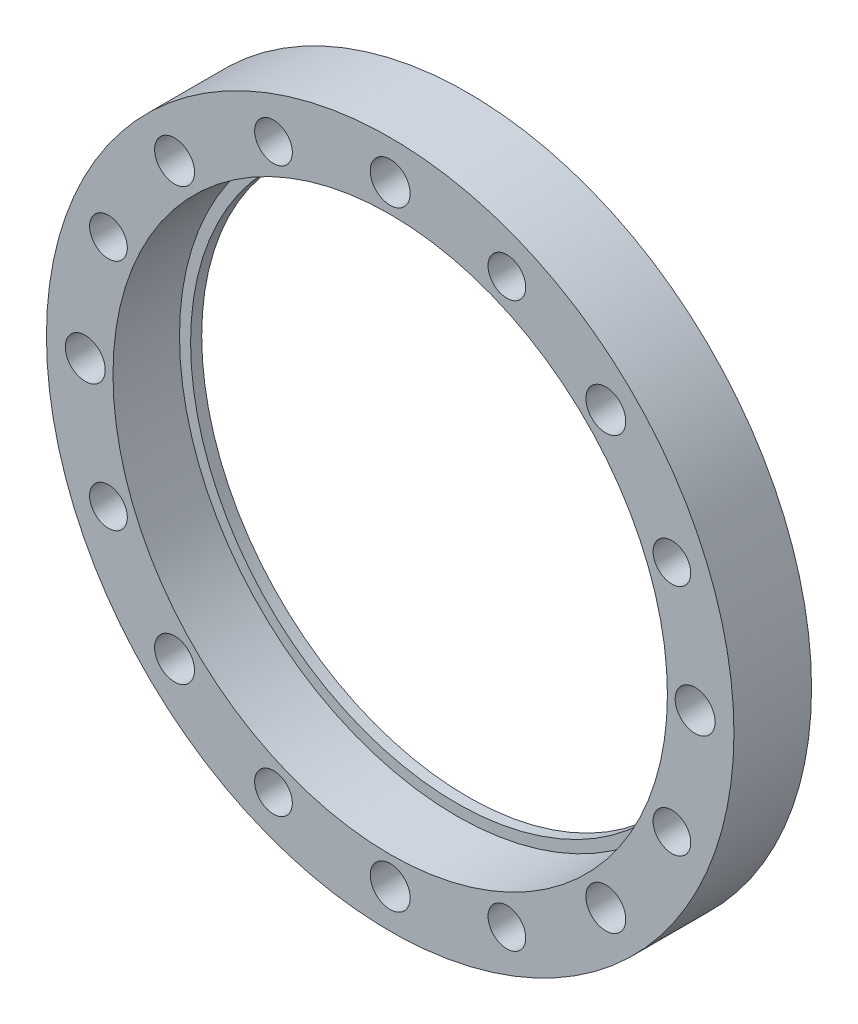
ISO-10303-21;
HEADER;
FILE_DESCRIPTION(('STEP AP214'),'2;1');
FILE_NAME('part.step','',(''),(''),'','','');
FILE_SCHEMA(('AUTOMOTIVE_DESIGN { 1 0 10303 214 1 1 1 1 }'));
ENDSEC;
DATA;
#1=APPLICATION_CONTEXT('core data for automotive mechanical design processes');
#2=APPLICATION_PROTOCOL_DEFINITION('international standard','automotive_design',2000,#1);
#3=PRODUCT_CONTEXT('',#1,'mechanical');
#4=PRODUCT('Part','Part','',(#3));
#5=PRODUCT_RELATED_PRODUCT_CATEGORY('part','',(#4));
#6=PRODUCT_DEFINITION_FORMATION('','',#4);
#7=PRODUCT_DEFINITION_CONTEXT('part definition',#1,'design');
#8=PRODUCT_DEFINITION('design','',#6,#7);
#9=PRODUCT_DEFINITION_SHAPE('','',#8);
#10=(LENGTH_UNIT() NAMED_UNIT(*) SI_UNIT(.MILLI.,.METRE.));
#11=(NAMED_UNIT(*) PLANE_ANGLE_UNIT() SI_UNIT($,.RADIAN.));
#12=(NAMED_UNIT(*) SI_UNIT($,.STERADIAN.) SOLID_ANGLE_UNIT());
#13=UNCERTAINTY_MEASURE_WITH_UNIT(LENGTH_MEASURE(1.E-05),#10,'distance_accuracy_value','');
#14=(GEOMETRIC_REPRESENTATION_CONTEXT(3) GLOBAL_UNCERTAINTY_ASSIGNED_CONTEXT((#13)) GLOBAL_UNIT_ASSIGNED_CONTEXT((#10,
#11,#12)) REPRESENTATION_CONTEXT('',''));
#15=CARTESIAN_POINT('',(0.,0.,0.));
#16=DIRECTION('',(0.,0.,1.));
#17=DIRECTION('',(1.,0.,0.));
#18=AXIS2_PLACEMENT_3D('',#15,#16,#17);
#19=CARTESIAN_POINT('',(0.,0.,6.));
#20=DIRECTION('',(0.,0.,-1.));
#21=DIRECTION('',(-1.,0.,0.));
#22=AXIS2_PLACEMENT_3D('',#19,#20,#21);
#23=CYLINDRICAL_SURFACE('',#22,31.);
#24=CARTESIAN_POINT('',(0.,0.,6.));
#25=DIRECTION('',(0.,0.,1.));
#26=DIRECTION('',(1.,0.,0.));
#27=AXIS2_PLACEMENT_3D('',#24,#25,#26);
#28=CIRCLE('',#27,31.);
#29=CARTESIAN_POINT('',(31.,0.,6.));
#30=VERTEX_POINT('',#29);
#31=EDGE_CURVE('E10',#30,#30,#28,.T.);
#32=ORIENTED_EDGE('',*,*,#31,.F.);
#33=EDGE_LOOP('',(#32));
#34=FACE_BOUND('',#33,.T.);
#35=CARTESIAN_POINT('',(0.,0.,-1.));
#36=DIRECTION('',(0.,0.,-1.));
#37=DIRECTION('',(-1.,0.,0.));
#38=AXIS2_PLACEMENT_3D('',#35,#36,#37);
#39=CIRCLE('',#38,31.);
#40=CARTESIAN_POINT('',(-31.,0.,-1.));
#41=VERTEX_POINT('',#40);
#42=EDGE_CURVE('E46',#41,#41,#39,.T.);
#43=ORIENTED_EDGE('',*,*,#42,.F.);
#44=EDGE_LOOP('',(#43));
#45=FACE_BOUND('',#44,.T.);
#46=ADVANCED_FACE('F31',(#34,#45),#23,.T.);
#47=CARTESIAN_POINT('',(0.,0.,6.));
#48=DIRECTION('',(0.,0.,1.));
#49=DIRECTION('',(1.,0.,0.));
#50=AXIS2_PLACEMENT_3D('',#47,#48,#49);
#51=PLANE('',#50);
#52=CARTESIAN_POINT('',(25.4066871440602,10.5237943900404,6.));
#53=DIRECTION('',(0.,0.,-1.));
#54=DIRECTION('',(-1.,0.,0.));
#55=AXIS2_PLACEMENT_3D('',#52,#53,#54);
#56=CIRCLE('',#55,1.7);
#57=CARTESIAN_POINT('',(23.7066871440602,10.5237943900404,6.));
#58=VERTEX_POINT('',#57);
#59=EDGE_CURVE('E170',#58,#58,#56,.T.);
#60=ORIENTED_EDGE('',*,*,#59,.T.);
#61=EDGE_LOOP('',(#60));
#62=FACE_BOUND('',#61,.T.);
#63=CARTESIAN_POINT('',(25.4066871440606,-10.5237943900395,6.));
#64=DIRECTION('',(0.,0.,-1.));
#65=DIRECTION('',(-1.,0.,0.));
#66=AXIS2_PLACEMENT_3D('',#63,#64,#65);
#67=CIRCLE('',#66,1.7);
#68=CARTESIAN_POINT('',(23.7066871440606,-10.5237943900395,6.));
#69=VERTEX_POINT('',#68);
#70=EDGE_CURVE('E164',#69,#69,#67,.T.);
#71=ORIENTED_EDGE('',*,*,#70,.T.);
#72=EDGE_LOOP('',(#71));
#73=FACE_BOUND('',#72,.T.);
#74=CARTESIAN_POINT('',(10.5237943900403,-25.4066871440602,6.));
#75=DIRECTION('',(0.,0.,-1.));
#76=DIRECTION('',(-1.,0.,0.));
#77=AXIS2_PLACEMENT_3D('',#74,#75,#76);
#78=CIRCLE('',#77,1.7);
#79=CARTESIAN_POINT('',(8.82379439004034,-25.4066871440602,6.));
#80=VERTEX_POINT('',#79);
#81=EDGE_CURVE('E158',#80,#80,#78,.T.);
#82=ORIENTED_EDGE('',*,*,#81,.T.);
#83=EDGE_LOOP('',(#82));
#84=FACE_BOUND('',#83,.T.);
#85=CARTESIAN_POINT('',(-10.5237943900398,-25.4066871440604,6.));
#86=DIRECTION('',(0.,0.,-1.));
#87=DIRECTION('',(-1.,0.,0.));
#88=AXIS2_PLACEMENT_3D('',#85,#86,#87);
#89=CIRCLE('',#88,1.7);
#90=CARTESIAN_POINT('',(-12.2237943900398,-25.4066871440604,6.));
#91=VERTEX_POINT('',#90);
#92=EDGE_CURVE('E152',#91,#91,#89,.T.);
#93=ORIENTED_EDGE('',*,*,#92,.T.);
#94=EDGE_LOOP('',(#93));
#95=FACE_BOUND('',#94,.T.);
#96=CARTESIAN_POINT('',(-25.4066871440603,-10.5237943900403,6.));
#97=DIRECTION('',(0.,0.,-1.));
#98=DIRECTION('',(-1.,0.,0.));
#99=AXIS2_PLACEMENT_3D('',#96,#97,#98);
#100=CIRCLE('',#99,1.7);
#101=CARTESIAN_POINT('',(-27.1066871440603,-10.5237943900403,6.));
#102=VERTEX_POINT('',#101);
#103=EDGE_CURVE('E146',#102,#102,#100,.T.);
#104=ORIENTED_EDGE('',*,*,#103,.T.);
#105=EDGE_LOOP('',(#104));
#106=FACE_BOUND('',#105,.T.);
#107=CARTESIAN_POINT('',(-25.4066871440605,10.5237943900397,6.));
#108=DIRECTION('',(0.,0.,-1.));
#109=DIRECTION('',(-1.,0.,0.));
#110=AXIS2_PLACEMENT_3D('',#107,#108,#109);
#111=CIRCLE('',#110,1.7);
#112=CARTESIAN_POINT('',(-27.1066871440605,10.5237943900397,6.));
#113=VERTEX_POINT('',#112);
#114=EDGE_CURVE('E140',#113,#113,#111,.T.);
#115=ORIENTED_EDGE('',*,*,#114,.T.);
#116=EDGE_LOOP('',(#115));
#117=FACE_BOUND('',#116,.T.);
#118=CARTESIAN_POINT('',(-10.5237943900402,25.4066871440603,6.));
#119=DIRECTION('',(0.,0.,-1.));
#120=DIRECTION('',(-1.,0.,0.));
#121=AXIS2_PLACEMENT_3D('',#118,#119,#120);
#122=CIRCLE('',#121,1.7);
#123=CARTESIAN_POINT('',(-12.2237943900402,25.4066871440603,6.));
#124=VERTEX_POINT('',#123);
#125=EDGE_CURVE('E134',#124,#124,#122,.T.);
#126=ORIENTED_EDGE('',*,*,#125,.T.);
#127=EDGE_LOOP('',(#126));
#128=FACE_BOUND('',#127,.T.);
#129=CARTESIAN_POINT('',(10.5237943900398,25.4066871440604,6.));
#130=DIRECTION('',(0.,0.,-1.));
#131=DIRECTION('',(-1.,0.,0.));
#132=AXIS2_PLACEMENT_3D('',#129,#130,#131);
#133=CIRCLE('',#132,1.7);
#134=CARTESIAN_POINT('',(8.82379439003982,25.4066871440604,6.));
#135=VERTEX_POINT('',#134);
#136=EDGE_CURVE('E128',#135,#135,#133,.T.);
#137=ORIENTED_EDGE('',*,*,#136,.T.);
#138=EDGE_LOOP('',(#137));
#139=FACE_BOUND('',#138,.T.);
#140=CARTESIAN_POINT('',(19.4454364826298,19.4454364826303,6.));
#141=DIRECTION('',(0.,0.,-1.));
#142=DIRECTION('',(-1.,0.,0.));
#143=AXIS2_PLACEMENT_3D('',#140,#141,#142);
#144=CIRCLE('',#143,1.8);
#145=CARTESIAN_POINT('',(17.6454364826298,19.4454364826303,6.));
#146=VERTEX_POINT('',#145);
#147=EDGE_CURVE('E119',#146,#146,#144,.T.);
#148=ORIENTED_EDGE('',*,*,#147,.T.);
#149=EDGE_LOOP('',(#148));
#150=FACE_BOUND('',#149,.T.);
#151=CARTESIAN_POINT('',(27.5,2.88047210454558E-13,6.));
#152=DIRECTION('',(0.,0.,-1.));
#153=DIRECTION('',(-1.,0.,0.));
#154=AXIS2_PLACEMENT_3D('',#151,#152,#153);
#155=CIRCLE('',#154,1.8);
#156=CARTESIAN_POINT('',(25.7,2.88047210454558E-13,6.));
#157=VERTEX_POINT('',#156);
#158=EDGE_CURVE('E110',#157,#157,#155,.T.);
#159=ORIENTED_EDGE('',*,*,#158,.T.);
#160=EDGE_LOOP('',(#159));
#161=FACE_BOUND('',#160,.T.);
#162=CARTESIAN_POINT('',(19.4454364826302,-19.4454364826299,6.));
#163=DIRECTION('',(0.,0.,-1.));
#164=DIRECTION('',(-1.,0.,0.));
#165=AXIS2_PLACEMENT_3D('',#162,#163,#164);
#166=CIRCLE('',#165,1.8);
#167=CARTESIAN_POINT('',(17.6454364826302,-19.4454364826299,6.));
#168=VERTEX_POINT('',#167);
#169=EDGE_CURVE('E101',#168,#168,#166,.T.);
#170=ORIENTED_EDGE('',*,*,#169,.T.);
#171=EDGE_LOOP('',(#170));
#172=FACE_BOUND('',#171,.T.);
#173=CARTESIAN_POINT('',(0.,-27.5,6.));
#174=DIRECTION('',(0.,0.,-1.));
#175=DIRECTION('',(-1.,0.,0.));
#176=AXIS2_PLACEMENT_3D('',#173,#174,#175);
#177=CIRCLE('',#176,1.8);
#178=CARTESIAN_POINT('',(-1.8,-27.5,6.));
#179=VERTEX_POINT('',#178);
#180=EDGE_CURVE('E92',#179,#179,#177,.T.);
#181=ORIENTED_EDGE('',*,*,#180,.T.);
#182=EDGE_LOOP('',(#181));
#183=FACE_BOUND('',#182,.T.);
#184=CARTESIAN_POINT('',(-19.44543648263,-19.4454364826302,6.));
#185=DIRECTION('',(0.,0.,-1.));
#186=DIRECTION('',(-1.,0.,0.));
#187=AXIS2_PLACEMENT_3D('',#184,#185,#186);
#188=CIRCLE('',#187,1.8);
#189=CARTESIAN_POINT('',(-21.24543648263,-19.4454364826302,6.));
#190=VERTEX_POINT('',#189);
#191=EDGE_CURVE('E83',#190,#190,#188,.T.);
#192=ORIENTED_EDGE('',*,*,#191,.T.);
#193=EDGE_LOOP('',(#192));
#194=FACE_BOUND('',#193,.T.);
#195=CARTESIAN_POINT('',(-27.5,0.,6.));
#196=DIRECTION('',(0.,0.,-1.));
#197=DIRECTION('',(-1.,0.,0.));
#198=AXIS2_PLACEMENT_3D('',#195,#196,#197);
#199=CIRCLE('',#198,1.8);
#200=CARTESIAN_POINT('',(-29.3,0.,6.));
#201=VERTEX_POINT('',#200);
#202=EDGE_CURVE('E74',#201,#201,#199,.T.);
#203=ORIENTED_EDGE('',*,*,#202,.T.);
#204=EDGE_LOOP('',(#203));
#205=FACE_BOUND('',#204,.T.);
#206=CARTESIAN_POINT('',(-19.4454364826301,19.44543648263,6.));
#207=DIRECTION('',(0.,0.,-1.));
#208=DIRECTION('',(-1.,0.,0.));
#209=AXIS2_PLACEMENT_3D('',#206,#207,#208);
#210=CIRCLE('',#209,1.8);
#211=CARTESIAN_POINT('',(-21.2454364826301,19.44543648263,6.));
#212=VERTEX_POINT('',#211);
#213=EDGE_CURVE('E65',#212,#212,#210,.T.);
#214=ORIENTED_EDGE('',*,*,#213,.T.);
#215=EDGE_LOOP('',(#214));
#216=FACE_BOUND('',#215,.T.);
#217=CARTESIAN_POINT('',(0.,27.5,6.));
#218=DIRECTION('',(0.,0.,-1.));
#219=DIRECTION('',(-1.,0.,0.));
#220=AXIS2_PLACEMENT_3D('',#217,#218,#219);
#221=CIRCLE('',#220,1.8);
#222=CARTESIAN_POINT('',(-1.8,27.5,6.));
#223=VERTEX_POINT('',#222);
#224=EDGE_CURVE('E54',#223,#223,#221,.T.);
#225=ORIENTED_EDGE('',*,*,#224,.T.);
#226=EDGE_LOOP('',(#225));
#227=FACE_BOUND('',#226,.T.);
#228=CARTESIAN_POINT('',(0.,0.,6.));
#229=DIRECTION('',(0.,0.,-1.));
#230=DIRECTION('',(-1.,0.,0.));
#231=AXIS2_PLACEMENT_3D('',#228,#229,#230);
#232=CIRCLE('',#231,25.);
#233=CARTESIAN_POINT('',(-25.,0.,6.));
#234=VERTEX_POINT('',#233);
#235=EDGE_CURVE('E37',#234,#234,#232,.T.);
#236=ORIENTED_EDGE('',*,*,#235,.T.);
#237=EDGE_LOOP('',(#236));
#238=FACE_BOUND('',#237,.T.);
#239=ORIENTED_EDGE('',*,*,#31,.T.);
#240=EDGE_LOOP('',(#239));
#241=FACE_BOUND('',#240,.T.);
#242=ADVANCED_FACE('F232',(#62,#73,#84,#95,#106,#117,#128,#139,#150,#161,#172,#183,#194,#205,
#216,#227,#238,#241),#51,.T.);
#243=CARTESIAN_POINT('',(0.,0.,6.));
#244=DIRECTION('',(0.,0.,-1.));
#245=DIRECTION('',(-1.,0.,0.));
#246=AXIS2_PLACEMENT_3D('',#243,#244,#245);
#247=CYLINDRICAL_SURFACE('',#246,25.);
#248=ORIENTED_EDGE('',*,*,#235,.F.);
#249=EDGE_LOOP('',(#248));
#250=FACE_BOUND('',#249,.T.);
#251=CARTESIAN_POINT('',(0.,0.,0.));
#252=DIRECTION('',(0.,0.,-1.));
#253=DIRECTION('',(-1.,0.,0.));
#254=AXIS2_PLACEMENT_3D('',#251,#252,#253);
#255=CIRCLE('',#254,25.);
#256=CARTESIAN_POINT('',(-25.,0.,0.));
#257=VERTEX_POINT('',#256);
#258=EDGE_CURVE('E41',#257,#257,#255,.T.);
#259=ORIENTED_EDGE('',*,*,#258,.T.);
#260=EDGE_LOOP('',(#259));
#261=FACE_BOUND('',#260,.T.);
#262=ADVANCED_FACE('F227',(#250,#261),#247,.F.);
#263=CARTESIAN_POINT('',(0.,0.,0.));
#264=DIRECTION('',(0.,0.,-1.));
#265=DIRECTION('',(-1.,0.,0.));
#266=AXIS2_PLACEMENT_3D('',#263,#264,#265);
#267=PLANE('',#266);
#268=CARTESIAN_POINT('',(0.,0.,0.));
#269=DIRECTION('',(0.,0.,-1.));
#270=DIRECTION('',(-1.,0.,0.));
#271=AXIS2_PLACEMENT_3D('',#268,#269,#270);
#272=CIRCLE('',#271,24.);
#273=CARTESIAN_POINT('',(-24.,0.,0.));
#274=VERTEX_POINT('',#273);
#275=EDGE_CURVE('E51',#274,#274,#272,.T.);
#276=ORIENTED_EDGE('',*,*,#275,.T.);
#277=EDGE_LOOP('',(#276));
#278=FACE_BOUND('',#277,.T.);
#279=ORIENTED_EDGE('',*,*,#258,.F.);
#280=EDGE_LOOP('',(#279));
#281=FACE_BOUND('',#280,.T.);
#282=ADVANCED_FACE('F183',(#278,#281),#267,.F.);
#283=CARTESIAN_POINT('',(0.,0.,-1.));
#284=DIRECTION('',(0.,0.,-1.));
#285=DIRECTION('',(-1.,0.,0.));
#286=AXIS2_PLACEMENT_3D('',#283,#284,#285);
#287=PLANE('',#286);
#288=CARTESIAN_POINT('',(25.4066871440602,10.5237943900404,-1.));
#289=DIRECTION('',(0.,0.,-1.));
#290=DIRECTION('',(-1.,0.,0.));
#291=AXIS2_PLACEMENT_3D('',#288,#289,#290);
#292=CIRCLE('',#291,1.69999999999999);
#293=CARTESIAN_POINT('',(23.7066871440602,10.5237943900404,-1.));
#294=VERTEX_POINT('',#293);
#295=EDGE_CURVE('E173',#294,#294,#292,.T.);
#296=ORIENTED_EDGE('',*,*,#295,.F.);
#297=EDGE_LOOP('',(#296));
#298=FACE_BOUND('',#297,.T.);
#299=CARTESIAN_POINT('',(25.4066871440606,-10.5237943900395,-1.));
#300=DIRECTION('',(0.,0.,-1.));
#301=DIRECTION('',(-1.,0.,0.));
#302=AXIS2_PLACEMENT_3D('',#299,#300,#301);
#303=CIRCLE('',#302,1.69999999999999);
#304=CARTESIAN_POINT('',(23.7066871440606,-10.5237943900395,-1.));
#305=VERTEX_POINT('',#304);
#306=EDGE_CURVE('E167',#305,#305,#303,.T.);
#307=ORIENTED_EDGE('',*,*,#306,.F.);
#308=EDGE_LOOP('',(#307));
#309=FACE_BOUND('',#308,.T.);
#310=CARTESIAN_POINT('',(10.5237943900403,-25.4066871440602,-1.));
#311=DIRECTION('',(0.,0.,-1.));
#312=DIRECTION('',(-1.,0.,0.));
#313=AXIS2_PLACEMENT_3D('',#310,#311,#312);
#314=CIRCLE('',#313,1.69999999999999);
#315=CARTESIAN_POINT('',(8.82379439004036,-25.4066871440602,-1.));
#316=VERTEX_POINT('',#315);
#317=EDGE_CURVE('E161',#316,#316,#314,.T.);
#318=ORIENTED_EDGE('',*,*,#317,.F.);
#319=EDGE_LOOP('',(#318));
#320=FACE_BOUND('',#319,.T.);
#321=CARTESIAN_POINT('',(-10.5237943900398,-25.4066871440604,-1.));
#322=DIRECTION('',(0.,0.,-1.));
#323=DIRECTION('',(-1.,0.,0.));
#324=AXIS2_PLACEMENT_3D('',#321,#322,#323);
#325=CIRCLE('',#324,1.69999999999999);
#326=CARTESIAN_POINT('',(-12.2237943900398,-25.4066871440604,-1.));
#327=VERTEX_POINT('',#326);
#328=EDGE_CURVE('E155',#327,#327,#325,.T.);
#329=ORIENTED_EDGE('',*,*,#328,.F.);
#330=EDGE_LOOP('',(#329));
#331=FACE_BOUND('',#330,.T.);
#332=CARTESIAN_POINT('',(-25.4066871440603,-10.5237943900403,-1.));
#333=DIRECTION('',(0.,0.,-1.));
#334=DIRECTION('',(-1.,0.,0.));
#335=AXIS2_PLACEMENT_3D('',#332,#333,#334);
#336=CIRCLE('',#335,1.69999999999999);
#337=CARTESIAN_POINT('',(-27.1066871440603,-10.5237943900403,-1.));
#338=VERTEX_POINT('',#337);
#339=EDGE_CURVE('E149',#338,#338,#336,.T.);
#340=ORIENTED_EDGE('',*,*,#339,.F.);
#341=EDGE_LOOP('',(#340));
#342=FACE_BOUND('',#341,.T.);
#343=CARTESIAN_POINT('',(-25.4066871440605,10.5237943900397,-1.));
#344=DIRECTION('',(0.,0.,-1.));
#345=DIRECTION('',(-1.,0.,0.));
#346=AXIS2_PLACEMENT_3D('',#343,#344,#345);
#347=CIRCLE('',#346,1.69999999999999);
#348=CARTESIAN_POINT('',(-27.1066871440605,10.5237943900397,-1.));
#349=VERTEX_POINT('',#348);
#350=EDGE_CURVE('E143',#349,#349,#347,.T.);
#351=ORIENTED_EDGE('',*,*,#350,.F.);
#352=EDGE_LOOP('',(#351));
#353=FACE_BOUND('',#352,.T.);
#354=CARTESIAN_POINT('',(-10.5237943900402,25.4066871440603,-1.));
#355=DIRECTION('',(0.,0.,-1.));
#356=DIRECTION('',(-1.,0.,0.));
#357=AXIS2_PLACEMENT_3D('',#354,#355,#356);
#358=CIRCLE('',#357,1.69999999999999);
#359=CARTESIAN_POINT('',(-12.2237943900402,25.4066871440603,-1.));
#360=VERTEX_POINT('',#359);
#361=EDGE_CURVE('E137',#360,#360,#358,.T.);
#362=ORIENTED_EDGE('',*,*,#361,.F.);
#363=EDGE_LOOP('',(#362));
#364=FACE_BOUND('',#363,.T.);
#365=CARTESIAN_POINT('',(10.5237943900398,25.4066871440604,-1.));
#366=DIRECTION('',(0.,0.,-1.));
#367=DIRECTION('',(-1.,0.,0.));
#368=AXIS2_PLACEMENT_3D('',#365,#366,#367);
#369=CIRCLE('',#368,1.69999999999999);
#370=CARTESIAN_POINT('',(8.82379439003983,25.4066871440604,-1.));
#371=VERTEX_POINT('',#370);
#372=EDGE_CURVE('E131',#371,#371,#369,.T.);
#373=ORIENTED_EDGE('',*,*,#372,.F.);
#374=EDGE_LOOP('',(#373));
#375=FACE_BOUND('',#374,.T.);
#376=CARTESIAN_POINT('',(19.4454364826298,19.4454364826303,-1.));
#377=DIRECTION('',(0.,0.,-1.));
#378=DIRECTION('',(-1.,0.,0.));
#379=AXIS2_PLACEMENT_3D('',#376,#377,#378);
#380=CIRCLE('',#379,3.15);
#381=CARTESIAN_POINT('',(16.2954364826298,19.4454364826303,-1.));
#382=VERTEX_POINT('',#381);
#383=EDGE_CURVE('E125',#382,#382,#380,.T.);
#384=ORIENTED_EDGE('',*,*,#383,.F.);
#385=EDGE_LOOP('',(#384));
#386=FACE_BOUND('',#385,.T.);
#387=CARTESIAN_POINT('',(27.5,2.88047210454558E-13,-1.));
#388=DIRECTION('',(0.,0.,-1.));
#389=DIRECTION('',(-1.,0.,0.));
#390=AXIS2_PLACEMENT_3D('',#387,#388,#389);
#391=CIRCLE('',#390,3.15);
#392=CARTESIAN_POINT('',(24.35,2.88047210454558E-13,-1.));
#393=VERTEX_POINT('',#392);
#394=EDGE_CURVE('E116',#393,#393,#391,.T.);
#395=ORIENTED_EDGE('',*,*,#394,.F.);
#396=EDGE_LOOP('',(#395));
#397=FACE_BOUND('',#396,.T.);
#398=CARTESIAN_POINT('',(19.4454364826302,-19.4454364826299,-1.));
#399=DIRECTION('',(0.,0.,-1.));
#400=DIRECTION('',(-1.,0.,0.));
#401=AXIS2_PLACEMENT_3D('',#398,#399,#400);
#402=CIRCLE('',#401,3.15);
#403=CARTESIAN_POINT('',(16.2954364826302,-19.4454364826299,-1.));
#404=VERTEX_POINT('',#403);
#405=EDGE_CURVE('E107',#404,#404,#402,.T.);
#406=ORIENTED_EDGE('',*,*,#405,.F.);
#407=EDGE_LOOP('',(#406));
#408=FACE_BOUND('',#407,.T.);
#409=CARTESIAN_POINT('',(0.,-27.5,-1.));
#410=DIRECTION('',(0.,0.,-1.));
#411=DIRECTION('',(-1.,0.,0.));
#412=AXIS2_PLACEMENT_3D('',#409,#410,#411);
#413=CIRCLE('',#412,3.15);
#414=CARTESIAN_POINT('',(-3.15,-27.5,-1.));
#415=VERTEX_POINT('',#414);
#416=EDGE_CURVE('E98',#415,#415,#413,.T.);
#417=ORIENTED_EDGE('',*,*,#416,.F.);
#418=EDGE_LOOP('',(#417));
#419=FACE_BOUND('',#418,.T.);
#420=CARTESIAN_POINT('',(-19.44543648263,-19.4454364826302,-1.));
#421=DIRECTION('',(0.,0.,-1.));
#422=DIRECTION('',(-1.,0.,0.));
#423=AXIS2_PLACEMENT_3D('',#420,#421,#422);
#424=CIRCLE('',#423,3.15);
#425=CARTESIAN_POINT('',(-22.59543648263,-19.4454364826302,-1.));
#426=VERTEX_POINT('',#425);
#427=EDGE_CURVE('E89',#426,#426,#424,.T.);
#428=ORIENTED_EDGE('',*,*,#427,.F.);
#429=EDGE_LOOP('',(#428));
#430=FACE_BOUND('',#429,.T.);
#431=CARTESIAN_POINT('',(-27.5,0.,-1.));
#432=DIRECTION('',(0.,0.,-1.));
#433=DIRECTION('',(-1.,0.,0.));
#434=AXIS2_PLACEMENT_3D('',#431,#432,#433);
#435=CIRCLE('',#434,3.15);
#436=CARTESIAN_POINT('',(-30.65,0.,-1.));
#437=VERTEX_POINT('',#436);
#438=EDGE_CURVE('E80',#437,#437,#435,.T.);
#439=ORIENTED_EDGE('',*,*,#438,.F.);
#440=EDGE_LOOP('',(#439));
#441=FACE_BOUND('',#440,.T.);
#442=CARTESIAN_POINT('',(-19.4454364826301,19.44543648263,-1.));
#443=DIRECTION('',(0.,0.,-1.));
#444=DIRECTION('',(-1.,0.,0.));
#445=AXIS2_PLACEMENT_3D('',#442,#443,#444);
#446=CIRCLE('',#445,3.15);
#447=CARTESIAN_POINT('',(-22.5954364826301,19.44543648263,-1.));
#448=VERTEX_POINT('',#447);
#449=EDGE_CURVE('E71',#448,#448,#446,.T.);
#450=ORIENTED_EDGE('',*,*,#449,.F.);
#451=EDGE_LOOP('',(#450));
#452=FACE_BOUND('',#451,.T.);
#453=CARTESIAN_POINT('',(0.,27.5,-1.));
#454=DIRECTION('',(0.,0.,-1.));
#455=DIRECTION('',(-1.,0.,0.));
#456=AXIS2_PLACEMENT_3D('',#453,#454,#455);
#457=CIRCLE('',#456,3.15);
#458=CARTESIAN_POINT('',(-3.15,27.5,-1.));
#459=VERTEX_POINT('',#458);
#460=EDGE_CURVE('E62',#459,#459,#457,.T.);
#461=ORIENTED_EDGE('',*,*,#460,.F.);
#462=EDGE_LOOP('',(#461));
#463=FACE_BOUND('',#462,.T.);
#464=ORIENTED_EDGE('',*,*,#42,.T.);
#465=EDGE_LOOP('',(#464));
#466=FACE_BOUND('',#465,.T.);
#467=CARTESIAN_POINT('',(0.,0.,-1.));
#468=DIRECTION('',(0.,0.,-1.));
#469=DIRECTION('',(-1.,0.,0.));
#470=AXIS2_PLACEMENT_3D('',#467,#468,#469);
#471=CIRCLE('',#470,24.);
#472=CARTESIAN_POINT('',(-24.,0.,-1.));
#473=VERTEX_POINT('',#472);
#474=EDGE_CURVE('E50',#473,#473,#471,.T.);
#475=ORIENTED_EDGE('',*,*,#474,.F.);
#476=EDGE_LOOP('',(#475));
#477=FACE_BOUND('',#476,.T.);
#478=ADVANCED_FACE('F179',(#298,#309,#320,#331,#342,#353,#364,#375,#386,#397,#408,#419,#430,
#441,#452,#463,#466,#477),#287,.T.);
#479=CARTESIAN_POINT('',(0.,0.,-1.));
#480=DIRECTION('',(0.,0.,1.));
#481=DIRECTION('',(1.,0.,0.));
#482=AXIS2_PLACEMENT_3D('',#479,#480,#481);
#483=CYLINDRICAL_SURFACE('',#482,24.);
#484=ORIENTED_EDGE('',*,*,#474,.T.);
#485=EDGE_LOOP('',(#484));
#486=FACE_BOUND('',#485,.T.);
#487=ORIENTED_EDGE('',*,*,#275,.F.);
#488=EDGE_LOOP('',(#487));
#489=FACE_BOUND('',#488,.T.);
#490=ADVANCED_FACE('F182',(#486,#489),#483,.F.);
#491=CARTESIAN_POINT('',(0.,27.5,-1.));
#492=DIRECTION('',(0.,0.,-1.));
#493=DIRECTION('',(-1.,0.,0.));
#494=AXIS2_PLACEMENT_3D('',#491,#492,#493);
#495=CYLINDRICAL_SURFACE('',#494,1.8);
#496=ORIENTED_EDGE('',*,*,#224,.F.);
#497=EDGE_LOOP('',(#496));
#498=FACE_BOUND('',#497,.T.);
#499=CARTESIAN_POINT('',(0.,27.5,0.35));
#500=DIRECTION('',(0.,0.,-1.));
#501=DIRECTION('',(-1.,0.,0.));
#502=AXIS2_PLACEMENT_3D('',#499,#500,#501);
#503=CIRCLE('',#502,1.8);
#504=CARTESIAN_POINT('',(-1.8,27.5,0.35));
#505=VERTEX_POINT('',#504);
#506=EDGE_CURVE('E59',#505,#505,#503,.T.);
#507=ORIENTED_EDGE('',*,*,#506,.T.);
#508=EDGE_LOOP('',(#507));
#509=FACE_BOUND('',#508,.T.);
#510=ADVANCED_FACE('F221',(#498,#509),#495,.F.);
#511=CARTESIAN_POINT('',(0.,27.5,-1.));
#512=DIRECTION('',(0.,0.,-1.));
#513=DIRECTION('',(-1.,0.,0.));
#514=AXIS2_PLACEMENT_3D('',#511,#512,#513);
#515=CONICAL_SURFACE('',#514,3.15,0.785398163397449);
#516=ORIENTED_EDGE('',*,*,#506,.F.);
#517=EDGE_LOOP('',(#516));
#518=FACE_BOUND('',#517,.T.);
#519=ORIENTED_EDGE('',*,*,#460,.T.);
#520=EDGE_LOOP('',(#519));
#521=FACE_BOUND('',#520,.T.);
#522=ADVANCED_FACE('F397',(#518,#521),#515,.F.);
#523=CARTESIAN_POINT('',(-19.4454364826301,19.44543648263,-1.));
#524=DIRECTION('',(0.,0.,-1.));
#525=DIRECTION('',(-1.,0.,0.));
#526=AXIS2_PLACEMENT_3D('',#523,#524,#525);
#527=CYLINDRICAL_SURFACE('',#526,1.8);
#528=ORIENTED_EDGE('',*,*,#213,.F.);
#529=EDGE_LOOP('',(#528));
#530=FACE_BOUND('',#529,.T.);
#531=CARTESIAN_POINT('',(-19.4454364826301,19.44543648263,0.35));
#532=DIRECTION('',(0.,0.,-1.));
#533=DIRECTION('',(-1.,0.,0.));
#534=AXIS2_PLACEMENT_3D('',#531,#532,#533);
#535=CIRCLE('',#534,1.8);
#536=CARTESIAN_POINT('',(-21.2454364826301,19.44543648263,0.35));
#537=VERTEX_POINT('',#536);
#538=EDGE_CURVE('E68',#537,#537,#535,.T.);
#539=ORIENTED_EDGE('',*,*,#538,.T.);
#540=EDGE_LOOP('',(#539));
#541=FACE_BOUND('',#540,.T.);
#542=ADVANCED_FACE('F393',(#530,#541),#527,.F.);
#543=CARTESIAN_POINT('',(-19.4454364826301,19.44543648263,-1.));
#544=DIRECTION('',(0.,0.,-1.));
#545=DIRECTION('',(-1.,0.,0.));
#546=AXIS2_PLACEMENT_3D('',#543,#544,#545);
#547=CONICAL_SURFACE('',#546,3.15,0.785398163397448);
#548=ORIENTED_EDGE('',*,*,#538,.F.);
#549=EDGE_LOOP('',(#548));
#550=FACE_BOUND('',#549,.T.);
#551=ORIENTED_EDGE('',*,*,#449,.T.);
#552=EDGE_LOOP('',(#551));
#553=FACE_BOUND('',#552,.T.);
#554=ADVANCED_FACE('F389',(#550,#553),#547,.F.);
#555=CARTESIAN_POINT('',(-27.5,0.,-1.));
#556=DIRECTION('',(0.,0.,-1.));
#557=DIRECTION('',(-1.,0.,0.));
#558=AXIS2_PLACEMENT_3D('',#555,#556,#557);
#559=CYLINDRICAL_SURFACE('',#558,1.8);
#560=ORIENTED_EDGE('',*,*,#202,.F.);
#561=EDGE_LOOP('',(#560));
#562=FACE_BOUND('',#561,.T.);
#563=CARTESIAN_POINT('',(-27.5,0.,0.35));
#564=DIRECTION('',(0.,0.,-1.));
#565=DIRECTION('',(-1.,0.,0.));
#566=AXIS2_PLACEMENT_3D('',#563,#564,#565);
#567=CIRCLE('',#566,1.8);
#568=CARTESIAN_POINT('',(-29.3,0.,0.35));
#569=VERTEX_POINT('',#568);
#570=EDGE_CURVE('E77',#569,#569,#567,.T.);
#571=ORIENTED_EDGE('',*,*,#570,.T.);
#572=EDGE_LOOP('',(#571));
#573=FACE_BOUND('',#572,.T.);
#574=ADVANCED_FACE('F385',(#562,#573),#559,.F.);
#575=CARTESIAN_POINT('',(-27.5,0.,-1.));
#576=DIRECTION('',(0.,0.,-1.));
#577=DIRECTION('',(-1.,0.,0.));
#578=AXIS2_PLACEMENT_3D('',#575,#576,#577);
#579=CONICAL_SURFACE('',#578,3.15,0.785398163397448);
#580=ORIENTED_EDGE('',*,*,#570,.F.);
#581=EDGE_LOOP('',(#580));
#582=FACE_BOUND('',#581,.T.);
#583=ORIENTED_EDGE('',*,*,#438,.T.);
#584=EDGE_LOOP('',(#583));
#585=FACE_BOUND('',#584,.T.);
#586=ADVANCED_FACE('F381',(#582,#585),#579,.F.);
#587=CARTESIAN_POINT('',(-19.44543648263,-19.4454364826302,-1.));
#588=DIRECTION('',(0.,0.,-1.));
#589=DIRECTION('',(-1.,0.,0.));
#590=AXIS2_PLACEMENT_3D('',#587,#588,#589);
#591=CYLINDRICAL_SURFACE('',#590,1.8);
#592=ORIENTED_EDGE('',*,*,#191,.F.);
#593=EDGE_LOOP('',(#592));
#594=FACE_BOUND('',#593,.T.);
#595=CARTESIAN_POINT('',(-19.44543648263,-19.4454364826302,0.35));
#596=DIRECTION('',(0.,0.,-1.));
#597=DIRECTION('',(-1.,0.,0.));
#598=AXIS2_PLACEMENT_3D('',#595,#596,#597);
#599=CIRCLE('',#598,1.8);
#600=CARTESIAN_POINT('',(-21.24543648263,-19.4454364826302,0.35));
#601=VERTEX_POINT('',#600);
#602=EDGE_CURVE('E86',#601,#601,#599,.T.);
#603=ORIENTED_EDGE('',*,*,#602,.T.);
#604=EDGE_LOOP('',(#603));
#605=FACE_BOUND('',#604,.T.);
#606=ADVANCED_FACE('F377',(#594,#605),#591,.F.);
#607=CARTESIAN_POINT('',(-19.44543648263,-19.4454364826302,-1.));
#608=DIRECTION('',(0.,0.,-1.));
#609=DIRECTION('',(-1.,0.,0.));
#610=AXIS2_PLACEMENT_3D('',#607,#608,#609);
#611=CONICAL_SURFACE('',#610,3.15,0.785398163397448);
#612=ORIENTED_EDGE('',*,*,#602,.F.);
#613=EDGE_LOOP('',(#612));
#614=FACE_BOUND('',#613,.T.);
#615=ORIENTED_EDGE('',*,*,#427,.T.);
#616=EDGE_LOOP('',(#615));
#617=FACE_BOUND('',#616,.T.);
#618=ADVANCED_FACE('F373',(#614,#617),#611,.F.);
#619=CARTESIAN_POINT('',(0.,-27.5,-1.));
#620=DIRECTION('',(0.,0.,-1.));
#621=DIRECTION('',(-1.,0.,0.));
#622=AXIS2_PLACEMENT_3D('',#619,#620,#621);
#623=CYLINDRICAL_SURFACE('',#622,1.8);
#624=ORIENTED_EDGE('',*,*,#180,.F.);
#625=EDGE_LOOP('',(#624));
#626=FACE_BOUND('',#625,.T.);
#627=CARTESIAN_POINT('',(0.,-27.5,0.35));
#628=DIRECTION('',(0.,0.,-1.));
#629=DIRECTION('',(-1.,0.,0.));
#630=AXIS2_PLACEMENT_3D('',#627,#628,#629);
#631=CIRCLE('',#630,1.8);
#632=CARTESIAN_POINT('',(-1.8,-27.5,0.35));
#633=VERTEX_POINT('',#632);
#634=EDGE_CURVE('E95',#633,#633,#631,.T.);
#635=ORIENTED_EDGE('',*,*,#634,.T.);
#636=EDGE_LOOP('',(#635));
#637=FACE_BOUND('',#636,.T.);
#638=ADVANCED_FACE('F369',(#626,#637),#623,.F.);
#639=CARTESIAN_POINT('',(0.,-27.5,-1.));
#640=DIRECTION('',(0.,0.,-1.));
#641=DIRECTION('',(-1.,0.,0.));
#642=AXIS2_PLACEMENT_3D('',#639,#640,#641);
#643=CONICAL_SURFACE('',#642,3.15,0.785398163397449);
#644=ORIENTED_EDGE('',*,*,#634,.F.);
#645=EDGE_LOOP('',(#644));
#646=FACE_BOUND('',#645,.T.);
#647=ORIENTED_EDGE('',*,*,#416,.T.);
#648=EDGE_LOOP('',(#647));
#649=FACE_BOUND('',#648,.T.);
#650=ADVANCED_FACE('F365',(#646,#649),#643,.F.);
#651=CARTESIAN_POINT('',(19.4454364826302,-19.4454364826299,-1.));
#652=DIRECTION('',(0.,0.,-1.));
#653=DIRECTION('',(-1.,0.,0.));
#654=AXIS2_PLACEMENT_3D('',#651,#652,#653);
#655=CYLINDRICAL_SURFACE('',#654,1.8);
#656=ORIENTED_EDGE('',*,*,#169,.F.);
#657=EDGE_LOOP('',(#656));
#658=FACE_BOUND('',#657,.T.);
#659=CARTESIAN_POINT('',(19.4454364826302,-19.4454364826299,0.35));
#660=DIRECTION('',(0.,0.,-1.));
#661=DIRECTION('',(-1.,0.,0.));
#662=AXIS2_PLACEMENT_3D('',#659,#660,#661);
#663=CIRCLE('',#662,1.8);
#664=CARTESIAN_POINT('',(17.6454364826302,-19.4454364826299,0.35));
#665=VERTEX_POINT('',#664);
#666=EDGE_CURVE('E104',#665,#665,#663,.T.);
#667=ORIENTED_EDGE('',*,*,#666,.T.);
#668=EDGE_LOOP('',(#667));
#669=FACE_BOUND('',#668,.T.);
#670=ADVANCED_FACE('F361',(#658,#669),#655,.F.);
#671=CARTESIAN_POINT('',(19.4454364826302,-19.4454364826299,-1.));
#672=DIRECTION('',(0.,0.,-1.));
#673=DIRECTION('',(-1.,0.,0.));
#674=AXIS2_PLACEMENT_3D('',#671,#672,#673);
#675=CONICAL_SURFACE('',#674,3.15,0.785398163397448);
#676=ORIENTED_EDGE('',*,*,#666,.F.);
#677=EDGE_LOOP('',(#676));
#678=FACE_BOUND('',#677,.T.);
#679=ORIENTED_EDGE('',*,*,#405,.T.);
#680=EDGE_LOOP('',(#679));
#681=FACE_BOUND('',#680,.T.);
#682=ADVANCED_FACE('F357',(#678,#681),#675,.F.);
#683=CARTESIAN_POINT('',(27.5,2.88047210454558E-13,-1.));
#684=DIRECTION('',(0.,0.,-1.));
#685=DIRECTION('',(-1.,0.,0.));
#686=AXIS2_PLACEMENT_3D('',#683,#684,#685);
#687=CYLINDRICAL_SURFACE('',#686,1.8);
#688=ORIENTED_EDGE('',*,*,#158,.F.);
#689=EDGE_LOOP('',(#688));
#690=FACE_BOUND('',#689,.T.);
#691=CARTESIAN_POINT('',(27.5,2.88047210454558E-13,0.35));
#692=DIRECTION('',(0.,0.,-1.));
#693=DIRECTION('',(-1.,0.,0.));
#694=AXIS2_PLACEMENT_3D('',#691,#692,#693);
#695=CIRCLE('',#694,1.8);
#696=CARTESIAN_POINT('',(25.7,2.88047210454558E-13,0.35));
#697=VERTEX_POINT('',#696);
#698=EDGE_CURVE('E113',#697,#697,#695,.T.);
#699=ORIENTED_EDGE('',*,*,#698,.T.);
#700=EDGE_LOOP('',(#699));
#701=FACE_BOUND('',#700,.T.);
#702=ADVANCED_FACE('F353',(#690,#701),#687,.F.);
#703=CARTESIAN_POINT('',(27.5,2.88047210454558E-13,-1.));
#704=DIRECTION('',(0.,0.,-1.));
#705=DIRECTION('',(-1.,0.,0.));
#706=AXIS2_PLACEMENT_3D('',#703,#704,#705);
#707=CONICAL_SURFACE('',#706,3.15,0.785398163397448);
#708=ORIENTED_EDGE('',*,*,#698,.F.);
#709=EDGE_LOOP('',(#708));
#710=FACE_BOUND('',#709,.T.);
#711=ORIENTED_EDGE('',*,*,#394,.T.);
#712=EDGE_LOOP('',(#711));
#713=FACE_BOUND('',#712,.T.);
#714=ADVANCED_FACE('F349',(#710,#713),#707,.F.);
#715=CARTESIAN_POINT('',(19.4454364826298,19.4454364826303,-1.));
#716=DIRECTION('',(0.,0.,-1.));
#717=DIRECTION('',(-1.,0.,0.));
#718=AXIS2_PLACEMENT_3D('',#715,#716,#717);
#719=CYLINDRICAL_SURFACE('',#718,1.8);
#720=ORIENTED_EDGE('',*,*,#147,.F.);
#721=EDGE_LOOP('',(#720));
#722=FACE_BOUND('',#721,.T.);
#723=CARTESIAN_POINT('',(19.4454364826298,19.4454364826303,0.35));
#724=DIRECTION('',(0.,0.,-1.));
#725=DIRECTION('',(-1.,0.,0.));
#726=AXIS2_PLACEMENT_3D('',#723,#724,#725);
#727=CIRCLE('',#726,1.8);
#728=CARTESIAN_POINT('',(17.6454364826298,19.4454364826303,0.35));
#729=VERTEX_POINT('',#728);
#730=EDGE_CURVE('E122',#729,#729,#727,.T.);
#731=ORIENTED_EDGE('',*,*,#730,.T.);
#732=EDGE_LOOP('',(#731));
#733=FACE_BOUND('',#732,.T.);
#734=ADVANCED_FACE('F345',(#722,#733),#719,.F.);
#735=CARTESIAN_POINT('',(19.4454364826298,19.4454364826303,-1.));
#736=DIRECTION('',(0.,0.,-1.));
#737=DIRECTION('',(-1.,0.,0.));
#738=AXIS2_PLACEMENT_3D('',#735,#736,#737);
#739=CONICAL_SURFACE('',#738,3.15,0.785398163397448);
#740=ORIENTED_EDGE('',*,*,#730,.F.);
#741=EDGE_LOOP('',(#740));
#742=FACE_BOUND('',#741,.T.);
#743=ORIENTED_EDGE('',*,*,#383,.T.);
#744=EDGE_LOOP('',(#743));
#745=FACE_BOUND('',#744,.T.);
#746=ADVANCED_FACE('F341',(#742,#745),#739,.F.);
#747=CARTESIAN_POINT('',(10.5237943900398,25.4066871440604,-1.));
#748=DIRECTION('',(0.,0.,-1.));
#749=DIRECTION('',(-1.,0.,0.));
#750=AXIS2_PLACEMENT_3D('',#747,#748,#749);
#751=CYLINDRICAL_SURFACE('',#750,1.69999999999999);
#752=ORIENTED_EDGE('',*,*,#136,.F.);
#753=EDGE_LOOP('',(#752));
#754=FACE_BOUND('',#753,.T.);
#755=ORIENTED_EDGE('',*,*,#372,.T.);
#756=EDGE_LOOP('',(#755));
#757=FACE_BOUND('',#756,.T.);
#758=ADVANCED_FACE('F257',(#754,#757),#751,.F.);
#759=CARTESIAN_POINT('',(-10.5237943900402,25.4066871440603,-1.));
#760=DIRECTION('',(0.,0.,-1.));
#761=DIRECTION('',(-1.,0.,0.));
#762=AXIS2_PLACEMENT_3D('',#759,#760,#761);
#763=CYLINDRICAL_SURFACE('',#762,1.69999999999999);
#764=ORIENTED_EDGE('',*,*,#125,.F.);
#765=EDGE_LOOP('',(#764));
#766=FACE_BOUND('',#765,.T.);
#767=ORIENTED_EDGE('',*,*,#361,.T.);
#768=EDGE_LOOP('',(#767));
#769=FACE_BOUND('',#768,.T.);
#770=ADVANCED_FACE('F270',(#766,#769),#763,.F.);
#771=CARTESIAN_POINT('',(-25.4066871440605,10.5237943900397,-1.));
#772=DIRECTION('',(0.,0.,-1.));
#773=DIRECTION('',(-1.,0.,0.));
#774=AXIS2_PLACEMENT_3D('',#771,#772,#773);
#775=CYLINDRICAL_SURFACE('',#774,1.69999999999999);
#776=ORIENTED_EDGE('',*,*,#114,.F.);
#777=EDGE_LOOP('',(#776));
#778=FACE_BOUND('',#777,.T.);
#779=ORIENTED_EDGE('',*,*,#350,.T.);
#780=EDGE_LOOP('',(#779));
#781=FACE_BOUND('',#780,.T.);
#782=ADVANCED_FACE('F275',(#778,#781),#775,.F.);
#783=CARTESIAN_POINT('',(-25.4066871440603,-10.5237943900403,-1.));
#784=DIRECTION('',(0.,0.,-1.));
#785=DIRECTION('',(-1.,0.,0.));
#786=AXIS2_PLACEMENT_3D('',#783,#784,#785);
#787=CYLINDRICAL_SURFACE('',#786,1.69999999999999);
#788=ORIENTED_EDGE('',*,*,#103,.F.);
#789=EDGE_LOOP('',(#788));
#790=FACE_BOUND('',#789,.T.);
#791=ORIENTED_EDGE('',*,*,#339,.T.);
#792=EDGE_LOOP('',(#791));
#793=FACE_BOUND('',#792,.T.);
#794=ADVANCED_FACE('F285',(#790,#793),#787,.F.);
#795=CARTESIAN_POINT('',(-10.5237943900398,-25.4066871440604,-1.));
#796=DIRECTION('',(0.,0.,-1.));
#797=DIRECTION('',(-1.,0.,0.));
#798=AXIS2_PLACEMENT_3D('',#795,#796,#797);
#799=CYLINDRICAL_SURFACE('',#798,1.69999999999999);
#800=ORIENTED_EDGE('',*,*,#92,.F.);
#801=EDGE_LOOP('',(#800));
#802=FACE_BOUND('',#801,.T.);
#803=ORIENTED_EDGE('',*,*,#328,.T.);
#804=EDGE_LOOP('',(#803));
#805=FACE_BOUND('',#804,.T.);
#806=ADVANCED_FACE('F295',(#802,#805),#799,.F.);
#807=CARTESIAN_POINT('',(10.5237943900403,-25.4066871440602,-1.));
#808=DIRECTION('',(0.,0.,-1.));
#809=DIRECTION('',(-1.,0.,0.));
#810=AXIS2_PLACEMENT_3D('',#807,#808,#809);
#811=CYLINDRICAL_SURFACE('',#810,1.69999999999999);
#812=ORIENTED_EDGE('',*,*,#81,.F.);
#813=EDGE_LOOP('',(#812));
#814=FACE_BOUND('',#813,.T.);
#815=ORIENTED_EDGE('',*,*,#317,.T.);
#816=EDGE_LOOP('',(#815));
#817=FACE_BOUND('',#816,.T.);
#818=ADVANCED_FACE('F305',(#814,#817),#811,.F.);
#819=CARTESIAN_POINT('',(25.4066871440606,-10.5237943900395,-1.));
#820=DIRECTION('',(0.,0.,-1.));
#821=DIRECTION('',(-1.,0.,0.));
#822=AXIS2_PLACEMENT_3D('',#819,#820,#821);
#823=CYLINDRICAL_SURFACE('',#822,1.69999999999999);
#824=ORIENTED_EDGE('',*,*,#70,.F.);
#825=EDGE_LOOP('',(#824));
#826=FACE_BOUND('',#825,.T.);
#827=ORIENTED_EDGE('',*,*,#306,.T.);
#828=EDGE_LOOP('',(#827));
#829=FACE_BOUND('',#828,.T.);
#830=ADVANCED_FACE('F315',(#826,#829),#823,.F.);
#831=CARTESIAN_POINT('',(25.4066871440602,10.5237943900404,-1.));
#832=DIRECTION('',(0.,0.,-1.));
#833=DIRECTION('',(-1.,0.,0.));
#834=AXIS2_PLACEMENT_3D('',#831,#832,#833);
#835=CYLINDRICAL_SURFACE('',#834,1.69999999999999);
#836=ORIENTED_EDGE('',*,*,#59,.F.);
#837=EDGE_LOOP('',(#836));
#838=FACE_BOUND('',#837,.T.);
#839=ORIENTED_EDGE('',*,*,#295,.T.);
#840=EDGE_LOOP('',(#839));
#841=FACE_BOUND('',#840,.T.);
#842=ADVANCED_FACE('F177',(#838,#841),#835,.F.);
#843=CLOSED_SHELL('',(#46,#242,#262,#282,#478,#490,#510,#522,#542,#554,#574,#586,#606,#618,#638,
#650,#670,#682,#702,#714,#734,#746,#758,#770,#782,#794,#806,#818,#830,#842));
#844=MANIFOLD_SOLID_BREP('B2',#843);
#845=ADVANCED_BREP_SHAPE_REPRESENTATION('',(#18,#844),#14);
#846=SHAPE_DEFINITION_REPRESENTATION(#9,#845);
ENDSEC;
END-ISO-10303-21;
